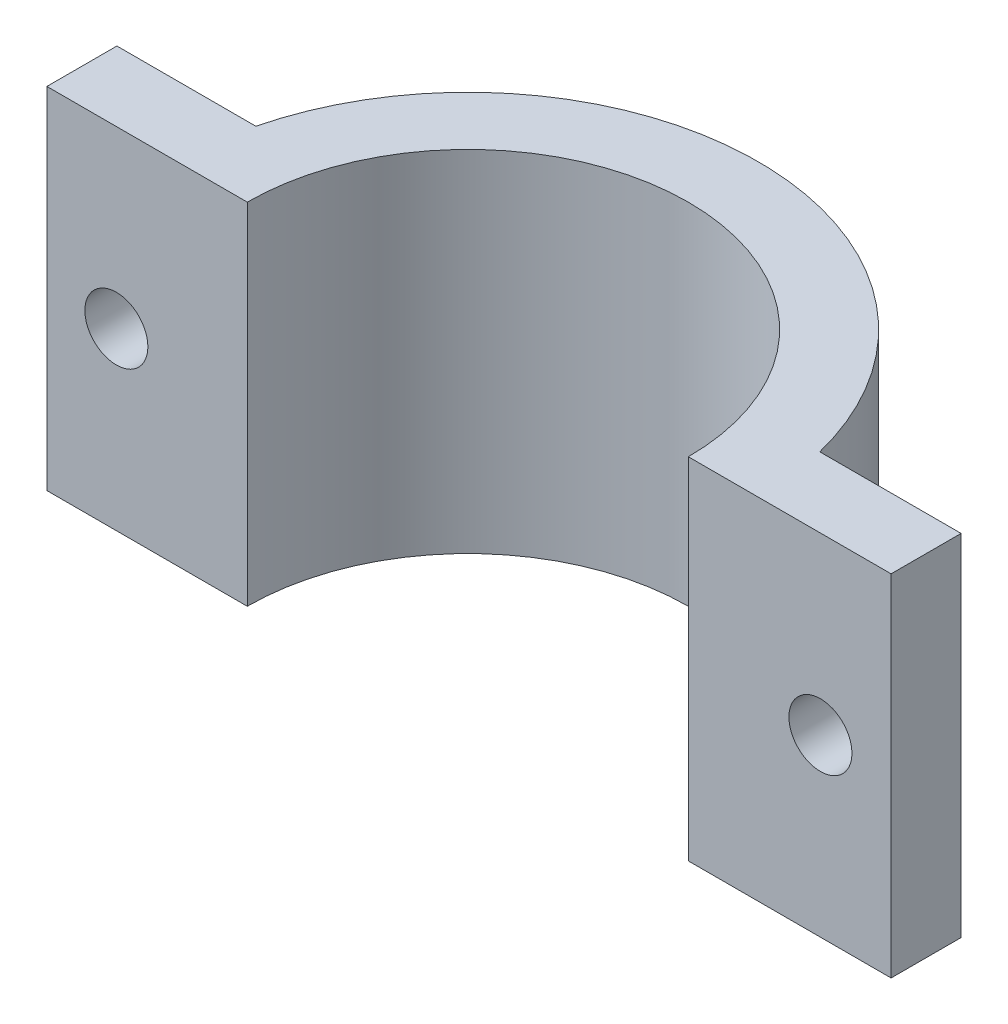
ISO-10303-21;
HEADER;
FILE_DESCRIPTION(('STEP AP214'),'2;1');
FILE_NAME('part.step','',(''),(''),'','','');
FILE_SCHEMA(('AUTOMOTIVE_DESIGN { 1 0 10303 214 1 1 1 1 }'));
ENDSEC;
DATA;
#1=APPLICATION_CONTEXT('core data for automotive mechanical design processes');
#2=APPLICATION_PROTOCOL_DEFINITION('international standard','automotive_design',2000,#1);
#3=PRODUCT_CONTEXT('',#1,'mechanical');
#4=PRODUCT('Part','Part','',(#3));
#5=PRODUCT_RELATED_PRODUCT_CATEGORY('part','',(#4));
#6=PRODUCT_DEFINITION_FORMATION('','',#4);
#7=PRODUCT_DEFINITION_CONTEXT('part definition',#1,'design');
#8=PRODUCT_DEFINITION('design','',#6,#7);
#9=PRODUCT_DEFINITION_SHAPE('','',#8);
#10=(LENGTH_UNIT() NAMED_UNIT(*) SI_UNIT(.MILLI.,.METRE.));
#11=(NAMED_UNIT(*) PLANE_ANGLE_UNIT() SI_UNIT($,.RADIAN.));
#12=(NAMED_UNIT(*) SI_UNIT($,.STERADIAN.) SOLID_ANGLE_UNIT());
#13=UNCERTAINTY_MEASURE_WITH_UNIT(LENGTH_MEASURE(1.E-05),#10,'distance_accuracy_value','');
#14=(GEOMETRIC_REPRESENTATION_CONTEXT(3) GLOBAL_UNCERTAINTY_ASSIGNED_CONTEXT((#13)) GLOBAL_UNIT_ASSIGNED_CONTEXT((#10,
#11,#12)) REPRESENTATION_CONTEXT('',''));
#15=CARTESIAN_POINT('',(0.,0.,0.));
#16=DIRECTION('',(0.,0.,1.));
#17=DIRECTION('',(1.,0.,0.));
#18=AXIS2_PLACEMENT_3D('',#15,#16,#17);
#19=CARTESIAN_POINT('',(-26.035,25.4,0.));
#20=DIRECTION('',(0.,0.,-1.));
#21=DIRECTION('',(-1.,0.,0.));
#22=AXIS2_PLACEMENT_3D('',#19,#20,#21);
#23=PLANE('',#22);
#24=CARTESIAN_POINT('',(-25.5019324775414,12.7,0.));
#25=DIRECTION('',(0.,0.,-1.));
#26=DIRECTION('',(1.,0.,0.));
#27=AXIS2_PLACEMENT_3D('',#24,#25,#26);
#28=CIRCLE('',#27,2.286);
#29=CARTESIAN_POINT('',(-23.2159324775414,12.7,0.));
#30=VERTEX_POINT('',#29);
#31=EDGE_CURVE('E182',#30,#30,#28,.T.);
#32=ORIENTED_EDGE('',*,*,#31,.T.);
#33=EDGE_LOOP('',(#32));
#34=FACE_BOUND('',#33,.T.);
#35=DIRECTION('',(1.,0.,0.));
#36=VECTOR('',#35,1.);
#37=CARTESIAN_POINT('',(-26.035,0.,0.));
#38=LINE('',#37,#36);
#39=CARTESIAN_POINT('',(-30.5430652639709,0.,0.));
#40=VERTEX_POINT('',#39);
#41=CARTESIAN_POINT('',(-16.002,0.,0.));
#42=VERTEX_POINT('',#41);
#43=EDGE_CURVE('E84',#40,#42,#38,.T.);
#44=ORIENTED_EDGE('',*,*,#43,.T.);
#45=DIRECTION('',(0.,-1.,0.));
#46=VECTOR('',#45,1.);
#47=CARTESIAN_POINT('',(-16.002,25.4,0.));
#48=LINE('',#47,#46);
#49=CARTESIAN_POINT('',(-16.002,25.4,0.));
#50=VERTEX_POINT('',#49);
#51=EDGE_CURVE('E11',#50,#42,#48,.T.);
#52=ORIENTED_EDGE('',*,*,#51,.F.);
#53=DIRECTION('',(1.,0.,0.));
#54=VECTOR('',#53,1.);
#55=CARTESIAN_POINT('',(-30.5430652639709,25.4,0.));
#56=LINE('',#55,#54);
#57=CARTESIAN_POINT('',(-30.5430652639709,25.4,0.));
#58=VERTEX_POINT('',#57);
#59=EDGE_CURVE('E90',#58,#50,#56,.T.);
#60=ORIENTED_EDGE('',*,*,#59,.F.);
#61=DIRECTION('',(0.,-1.,0.));
#62=VECTOR('',#61,1.);
#63=CARTESIAN_POINT('',(-30.5430652639709,25.4,0.));
#64=LINE('',#63,#62);
#65=EDGE_CURVE('E125',#58,#40,#64,.T.);
#66=ORIENTED_EDGE('',*,*,#65,.T.);
#67=EDGE_LOOP('',(#44,#52,#60,#66));
#68=FACE_BOUND('',#67,.T.);
#69=ADVANCED_FACE('F33',(#34,#68),#23,.F.);
#70=CARTESIAN_POINT('',(0.,25.4,0.));
#71=DIRECTION('',(0.,-1.,0.));
#72=DIRECTION('',(0.,0.,-1.));
#73=AXIS2_PLACEMENT_3D('',#70,#71,#72);
#74=CYLINDRICAL_SURFACE('',#73,16.002);
#75=CARTESIAN_POINT('',(0.,0.,0.));
#76=DIRECTION('',(0.,-1.,0.));
#77=DIRECTION('',(0.,0.,1.));
#78=AXIS2_PLACEMENT_3D('',#75,#76,#77);
#79=CIRCLE('',#78,16.002);
#80=CARTESIAN_POINT('',(16.002,0.,0.));
#81=VERTEX_POINT('',#80);
#82=EDGE_CURVE('E130',#42,#81,#79,.T.);
#83=ORIENTED_EDGE('',*,*,#82,.T.);
#84=DIRECTION('',(0.,-1.,0.));
#85=VECTOR('',#84,1.);
#86=CARTESIAN_POINT('',(16.002,25.4,0.));
#87=LINE('',#86,#85);
#88=CARTESIAN_POINT('',(16.002,25.4,0.));
#89=VERTEX_POINT('',#88);
#90=EDGE_CURVE('E41',#89,#81,#87,.T.);
#91=ORIENTED_EDGE('',*,*,#90,.F.);
#92=CARTESIAN_POINT('',(0.,25.4,0.));
#93=DIRECTION('',(0.,-1.,0.));
#94=DIRECTION('',(0.,0.,1.));
#95=AXIS2_PLACEMENT_3D('',#92,#93,#94);
#96=CIRCLE('',#95,16.002);
#97=EDGE_CURVE('E164',#50,#89,#96,.T.);
#98=ORIENTED_EDGE('',*,*,#97,.F.);
#99=ORIENTED_EDGE('',*,*,#51,.T.);
#100=EDGE_LOOP('',(#83,#91,#98,#99));
#101=FACE_BOUND('',#100,.T.);
#102=ADVANCED_FACE('F163',(#101),#74,.F.);
#103=CARTESIAN_POINT('',(30.7166505492892,25.4,0.));
#104=DIRECTION('',(0.,0.,-1.));
#105=DIRECTION('',(-1.,0.,0.));
#106=AXIS2_PLACEMENT_3D('',#103,#104,#105);
#107=PLANE('',#106);
#108=CARTESIAN_POINT('',(25.588725120203,12.7,0.));
#109=DIRECTION('',(0.,0.,-1.));
#110=DIRECTION('',(-1.,0.,0.));
#111=AXIS2_PLACEMENT_3D('',#108,#109,#110);
#112=CIRCLE('',#111,2.286);
#113=CARTESIAN_POINT('',(23.302725120203,12.7,0.));
#114=VERTEX_POINT('',#113);
#115=EDGE_CURVE('E131',#114,#114,#112,.T.);
#116=ORIENTED_EDGE('',*,*,#115,.T.);
#117=EDGE_LOOP('',(#116));
#118=FACE_BOUND('',#117,.T.);
#119=DIRECTION('',(1.,0.,0.));
#120=VECTOR('',#119,1.);
#121=CARTESIAN_POINT('',(30.7166505492892,0.,0.));
#122=LINE('',#121,#120);
#123=CARTESIAN_POINT('',(30.7166505492892,0.,0.));
#124=VERTEX_POINT('',#123);
#125=EDGE_CURVE('E134',#81,#124,#122,.T.);
#126=ORIENTED_EDGE('',*,*,#125,.T.);
#127=DIRECTION('',(0.,-1.,0.));
#128=VECTOR('',#127,1.);
#129=CARTESIAN_POINT('',(30.7166505492892,25.4,0.));
#130=LINE('',#129,#128);
#131=CARTESIAN_POINT('',(30.7166505492892,25.4,0.));
#132=VERTEX_POINT('',#131);
#133=EDGE_CURVE('E152',#132,#124,#130,.T.);
#134=ORIENTED_EDGE('',*,*,#133,.F.);
#135=DIRECTION('',(1.,0.,0.));
#136=VECTOR('',#135,1.);
#137=CARTESIAN_POINT('',(16.002,25.4,0.));
#138=LINE('',#137,#136);
#139=EDGE_CURVE('E160',#89,#132,#138,.T.);
#140=ORIENTED_EDGE('',*,*,#139,.F.);
#141=ORIENTED_EDGE('',*,*,#90,.T.);
#142=EDGE_LOOP('',(#126,#134,#140,#141));
#143=FACE_BOUND('',#142,.T.);
#144=ADVANCED_FACE('F158',(#118,#143),#107,.F.);
#145=CARTESIAN_POINT('',(30.7166505492892,25.4,-5.08000000000001));
#146=DIRECTION('',(-1.,0.,0.));
#147=DIRECTION('',(0.,0.,1.));
#148=AXIS2_PLACEMENT_3D('',#145,#146,#147);
#149=PLANE('',#148);
#150=DIRECTION('',(0.,0.,-1.));
#151=VECTOR('',#150,1.);
#152=CARTESIAN_POINT('',(30.7166505492892,0.,-5.08000000000001));
#153=LINE('',#152,#151);
#154=CARTESIAN_POINT('',(30.7166505492892,0.,-5.08000000000001));
#155=VERTEX_POINT('',#154);
#156=EDGE_CURVE('E136',#124,#155,#153,.T.);
#157=ORIENTED_EDGE('',*,*,#156,.T.);
#158=DIRECTION('',(0.,-1.,0.));
#159=VECTOR('',#158,1.);
#160=CARTESIAN_POINT('',(30.7166505492892,25.4,-5.08000000000001));
#161=LINE('',#160,#159);
#162=CARTESIAN_POINT('',(30.7166505492892,25.4,-5.08000000000001));
#163=VERTEX_POINT('',#162);
#164=EDGE_CURVE('E149',#163,#155,#161,.T.);
#165=ORIENTED_EDGE('',*,*,#164,.F.);
#166=DIRECTION('',(0.,0.,-1.));
#167=VECTOR('',#166,1.);
#168=CARTESIAN_POINT('',(30.7166505492892,25.4,-5.08000000000001));
#169=LINE('',#168,#167);
#170=EDGE_CURVE('E173',#132,#163,#169,.T.);
#171=ORIENTED_EDGE('',*,*,#170,.F.);
#172=ORIENTED_EDGE('',*,*,#133,.T.);
#173=EDGE_LOOP('',(#157,#165,#171,#172));
#174=FACE_BOUND('',#173,.T.);
#175=ADVANCED_FACE('F169',(#174),#149,.F.);
#176=CARTESIAN_POINT('',(20.4607996911167,25.4,-5.08000000000001));
#177=DIRECTION('',(0.,0.,1.));
#178=DIRECTION('',(1.,0.,0.));
#179=AXIS2_PLACEMENT_3D('',#176,#177,#178);
#180=PLANE('',#179);
#181=CARTESIAN_POINT('',(25.588725120203,12.7,-5.08000000000001));
#182=DIRECTION('',(0.,0.,-1.));
#183=DIRECTION('',(-1.,0.,0.));
#184=AXIS2_PLACEMENT_3D('',#181,#182,#183);
#185=CIRCLE('',#184,2.286);
#186=CARTESIAN_POINT('',(23.302725120203,12.7,-5.08000000000001));
#187=VERTEX_POINT('',#186);
#188=EDGE_CURVE('E185',#187,#187,#185,.T.);
#189=ORIENTED_EDGE('',*,*,#188,.F.);
#190=EDGE_LOOP('',(#189));
#191=FACE_BOUND('',#190,.T.);
#192=DIRECTION('',(-1.,0.,0.));
#193=VECTOR('',#192,1.);
#194=CARTESIAN_POINT('',(20.4607996911167,0.,-5.08000000000001));
#195=LINE('',#194,#193);
#196=CARTESIAN_POINT('',(20.4607996911167,0.,-5.08000000000001));
#197=VERTEX_POINT('',#196);
#198=EDGE_CURVE('E139',#155,#197,#195,.T.);
#199=ORIENTED_EDGE('',*,*,#198,.T.);
#200=DIRECTION('',(0.,-1.,0.));
#201=VECTOR('',#200,1.);
#202=CARTESIAN_POINT('',(20.4607996911167,25.4,-5.08000000000001));
#203=LINE('',#202,#201);
#204=CARTESIAN_POINT('',(20.4607996911167,25.4,-5.08000000000001));
#205=VERTEX_POINT('',#204);
#206=EDGE_CURVE('E120',#205,#197,#203,.T.);
#207=ORIENTED_EDGE('',*,*,#206,.F.);
#208=DIRECTION('',(-1.,0.,0.));
#209=VECTOR('',#208,1.);
#210=CARTESIAN_POINT('',(26.035,25.4,-5.08000000000001));
#211=LINE('',#210,#209);
#212=EDGE_CURVE('E110',#163,#205,#211,.T.);
#213=ORIENTED_EDGE('',*,*,#212,.F.);
#214=ORIENTED_EDGE('',*,*,#164,.T.);
#215=EDGE_LOOP('',(#199,#207,#213,#214));
#216=FACE_BOUND('',#215,.T.);
#217=ADVANCED_FACE('F172',(#191,#216),#180,.F.);
#218=CARTESIAN_POINT('',(0.,25.4,0.));
#219=DIRECTION('',(0.,-1.,0.));
#220=DIRECTION('',(0.,0.,-1.));
#221=AXIS2_PLACEMENT_3D('',#218,#219,#220);
#222=CYLINDRICAL_SURFACE('',#221,21.082);
#223=CARTESIAN_POINT('',(0.,0.,0.));
#224=DIRECTION('',(0.,1.,0.));
#225=DIRECTION('',(0.,0.,1.));
#226=AXIS2_PLACEMENT_3D('',#223,#224,#225);
#227=CIRCLE('',#226,21.082);
#228=CARTESIAN_POINT('',(-20.4607996911167,0.,-5.08000000000001));
#229=VERTEX_POINT('',#228);
#230=EDGE_CURVE('E119',#197,#229,#227,.T.);
#231=ORIENTED_EDGE('',*,*,#230,.T.);
#232=DIRECTION('',(0.,-1.,0.));
#233=VECTOR('',#232,1.);
#234=CARTESIAN_POINT('',(-20.4607996911167,25.4,-5.08000000000001));
#235=LINE('',#234,#233);
#236=CARTESIAN_POINT('',(-20.4607996911167,25.4,-5.08000000000001));
#237=VERTEX_POINT('',#236);
#238=EDGE_CURVE('E116',#237,#229,#235,.T.);
#239=ORIENTED_EDGE('',*,*,#238,.F.);
#240=CARTESIAN_POINT('',(0.,25.4,0.));
#241=DIRECTION('',(0.,1.,0.));
#242=DIRECTION('',(0.,0.,1.));
#243=AXIS2_PLACEMENT_3D('',#240,#241,#242);
#244=CIRCLE('',#243,21.082);
#245=EDGE_CURVE('E104',#205,#237,#244,.T.);
#246=ORIENTED_EDGE('',*,*,#245,.F.);
#247=ORIENTED_EDGE('',*,*,#206,.T.);
#248=EDGE_LOOP('',(#231,#239,#246,#247));
#249=FACE_BOUND('',#248,.T.);
#250=ADVANCED_FACE('F117',(#249),#222,.T.);
#251=CARTESIAN_POINT('',(-26.035,25.4,-5.08));
#252=DIRECTION('',(0.,0.,1.));
#253=DIRECTION('',(1.,0.,0.));
#254=AXIS2_PLACEMENT_3D('',#251,#252,#253);
#255=PLANE('',#254);
#256=CARTESIAN_POINT('',(-25.5019324775414,12.7,-5.08000000000001));
#257=DIRECTION('',(0.,0.,-1.));
#258=DIRECTION('',(1.,0.,0.));
#259=AXIS2_PLACEMENT_3D('',#256,#257,#258);
#260=CIRCLE('',#259,2.286);
#261=CARTESIAN_POINT('',(-23.2159324775414,12.7,-5.08000000000001));
#262=VERTEX_POINT('',#261);
#263=EDGE_CURVE('E179',#262,#262,#260,.T.);
#264=ORIENTED_EDGE('',*,*,#263,.F.);
#265=EDGE_LOOP('',(#264));
#266=FACE_BOUND('',#265,.T.);
#267=DIRECTION('',(-1.,0.,0.));
#268=VECTOR('',#267,1.);
#269=CARTESIAN_POINT('',(-26.035,0.,-5.08));
#270=LINE('',#269,#268);
#271=CARTESIAN_POINT('',(-30.5430652639709,0.,-5.08));
#272=VERTEX_POINT('',#271);
#273=EDGE_CURVE('E77',#229,#272,#270,.T.);
#274=ORIENTED_EDGE('',*,*,#273,.T.);
#275=DIRECTION('',(0.,-1.,0.));
#276=VECTOR('',#275,1.);
#277=CARTESIAN_POINT('',(-30.5430652639709,25.4,-5.08));
#278=LINE('',#277,#276);
#279=CARTESIAN_POINT('',(-30.5430652639709,25.4,-5.08));
#280=VERTEX_POINT('',#279);
#281=EDGE_CURVE('E121',#280,#272,#278,.T.);
#282=ORIENTED_EDGE('',*,*,#281,.F.);
#283=DIRECTION('',(-1.,0.,0.));
#284=VECTOR('',#283,1.);
#285=CARTESIAN_POINT('',(-26.035,25.4,-5.08));
#286=LINE('',#285,#284);
#287=EDGE_CURVE('E108',#237,#280,#286,.T.);
#288=ORIENTED_EDGE('',*,*,#287,.F.);
#289=ORIENTED_EDGE('',*,*,#238,.T.);
#290=EDGE_LOOP('',(#274,#282,#288,#289));
#291=FACE_BOUND('',#290,.T.);
#292=ADVANCED_FACE('F123',(#266,#291),#255,.F.);
#293=CARTESIAN_POINT('',(-30.5430652639709,25.4,-5.08));
#294=DIRECTION('',(1.,0.,0.));
#295=DIRECTION('',(0.,0.,-1.));
#296=AXIS2_PLACEMENT_3D('',#293,#294,#295);
#297=PLANE('',#296);
#298=DIRECTION('',(0.,0.,1.));
#299=VECTOR('',#298,1.);
#300=CARTESIAN_POINT('',(-30.5430652639709,0.,-5.08));
#301=LINE('',#300,#299);
#302=EDGE_CURVE('E143',#272,#40,#301,.T.);
#303=ORIENTED_EDGE('',*,*,#302,.T.);
#304=ORIENTED_EDGE('',*,*,#65,.F.);
#305=DIRECTION('',(0.,0.,1.));
#306=VECTOR('',#305,1.);
#307=CARTESIAN_POINT('',(-30.5430652639709,25.4,-5.08));
#308=LINE('',#307,#306);
#309=EDGE_CURVE('E49',#280,#58,#308,.T.);
#310=ORIENTED_EDGE('',*,*,#309,.F.);
#311=ORIENTED_EDGE('',*,*,#281,.T.);
#312=EDGE_LOOP('',(#303,#304,#310,#311));
#313=FACE_BOUND('',#312,.T.);
#314=ADVANCED_FACE('F215',(#313),#297,.F.);
#315=CARTESIAN_POINT('',(0.,25.4,0.));
#316=DIRECTION('',(0.,1.,0.));
#317=DIRECTION('',(0.,0.,1.));
#318=AXIS2_PLACEMENT_3D('',#315,#316,#317);
#319=PLANE('',#318);
#320=ORIENTED_EDGE('',*,*,#59,.T.);
#321=ORIENTED_EDGE('',*,*,#97,.T.);
#322=ORIENTED_EDGE('',*,*,#139,.T.);
#323=ORIENTED_EDGE('',*,*,#170,.T.);
#324=ORIENTED_EDGE('',*,*,#212,.T.);
#325=ORIENTED_EDGE('',*,*,#245,.T.);
#326=ORIENTED_EDGE('',*,*,#287,.T.);
#327=ORIENTED_EDGE('',*,*,#309,.T.);
#328=EDGE_LOOP('',(#320,#321,#322,#323,#324,#325,#326,#327));
#329=FACE_BOUND('',#328,.T.);
#330=ADVANCED_FACE('F106',(#329),#319,.T.);
#331=CARTESIAN_POINT('',(0.,0.,0.));
#332=DIRECTION('',(0.,1.,0.));
#333=DIRECTION('',(0.,0.,1.));
#334=AXIS2_PLACEMENT_3D('',#331,#332,#333);
#335=PLANE('',#334);
#336=ORIENTED_EDGE('',*,*,#43,.F.);
#337=ORIENTED_EDGE('',*,*,#302,.F.);
#338=ORIENTED_EDGE('',*,*,#273,.F.);
#339=ORIENTED_EDGE('',*,*,#230,.F.);
#340=ORIENTED_EDGE('',*,*,#198,.F.);
#341=ORIENTED_EDGE('',*,*,#156,.F.);
#342=ORIENTED_EDGE('',*,*,#125,.F.);
#343=ORIENTED_EDGE('',*,*,#82,.F.);
#344=EDGE_LOOP('',(#336,#337,#338,#339,#340,#341,#342,#343));
#345=FACE_BOUND('',#344,.T.);
#346=ADVANCED_FACE('F165',(#345),#335,.F.);
#347=CARTESIAN_POINT('',(-25.5019324775414,12.7,0.));
#348=DIRECTION('',(0.,0.,-1.));
#349=DIRECTION('',(-1.,0.,0.));
#350=AXIS2_PLACEMENT_3D('',#347,#348,#349);
#351=CYLINDRICAL_SURFACE('',#350,2.286);
#352=ORIENTED_EDGE('',*,*,#31,.F.);
#353=EDGE_LOOP('',(#352));
#354=FACE_BOUND('',#353,.T.);
#355=ORIENTED_EDGE('',*,*,#263,.T.);
#356=EDGE_LOOP('',(#355));
#357=FACE_BOUND('',#356,.T.);
#358=ADVANCED_FACE('F195',(#354,#357),#351,.F.);
#359=CARTESIAN_POINT('',(25.588725120203,12.7,0.));
#360=DIRECTION('',(0.,0.,-1.));
#361=DIRECTION('',(-1.,0.,0.));
#362=AXIS2_PLACEMENT_3D('',#359,#360,#361);
#363=CYLINDRICAL_SURFACE('',#362,2.286);
#364=ORIENTED_EDGE('',*,*,#115,.F.);
#365=EDGE_LOOP('',(#364));
#366=FACE_BOUND('',#365,.T.);
#367=ORIENTED_EDGE('',*,*,#188,.T.);
#368=EDGE_LOOP('',(#367));
#369=FACE_BOUND('',#368,.T.);
#370=ADVANCED_FACE('F192',(#366,#369),#363,.F.);
#371=CLOSED_SHELL('',(#69,#102,#144,#175,#217,#250,#292,#314,#330,#346,#358,#370));
#372=MANIFOLD_SOLID_BREP('B2',#371);
#373=ADVANCED_BREP_SHAPE_REPRESENTATION('',(#18,#372),#14);
#374=SHAPE_DEFINITION_REPRESENTATION(#9,#373);
ENDSEC;
END-ISO-10303-21;
